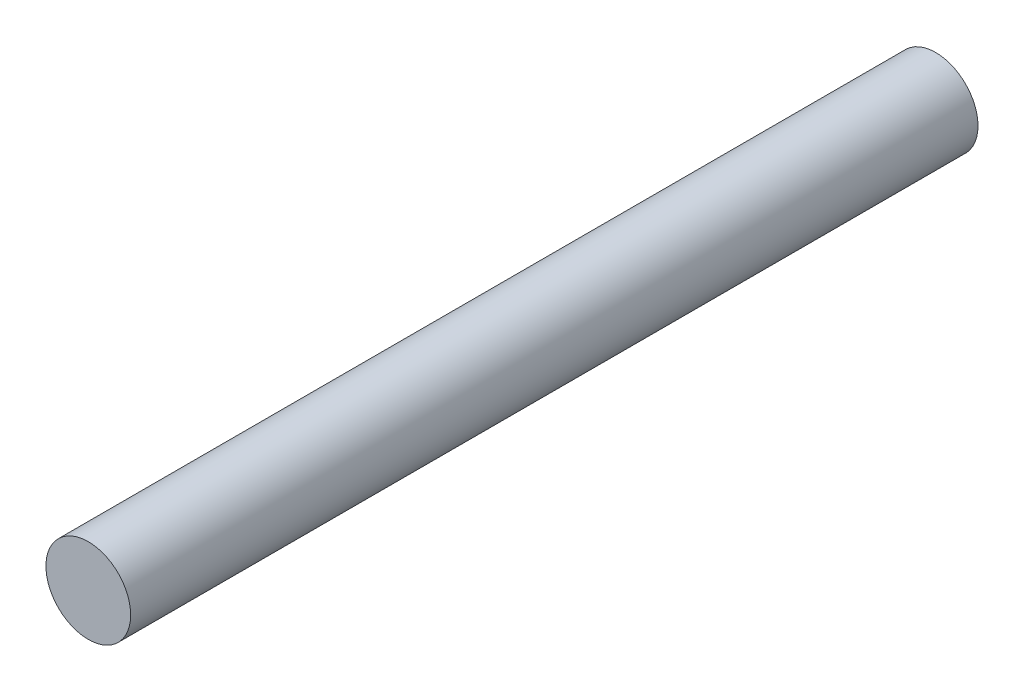
ISO-10303-21;
HEADER;
FILE_DESCRIPTION(('STEP AP214'),'2;1');
FILE_NAME('part.step','',(''),(''),'','','');
FILE_SCHEMA(('AUTOMOTIVE_DESIGN { 1 0 10303 214 1 1 1 1 }'));
ENDSEC;
DATA;
#1=APPLICATION_CONTEXT('core data for automotive mechanical design processes');
#2=APPLICATION_PROTOCOL_DEFINITION('international standard','automotive_design',2000,#1);
#3=PRODUCT_CONTEXT('',#1,'mechanical');
#4=PRODUCT('Part','Part','',(#3));
#5=PRODUCT_RELATED_PRODUCT_CATEGORY('part','',(#4));
#6=PRODUCT_DEFINITION_FORMATION('','',#4);
#7=PRODUCT_DEFINITION_CONTEXT('part definition',#1,'design');
#8=PRODUCT_DEFINITION('design','',#6,#7);
#9=PRODUCT_DEFINITION_SHAPE('','',#8);
#10=(LENGTH_UNIT() NAMED_UNIT(*) SI_UNIT(.MILLI.,.METRE.));
#11=(NAMED_UNIT(*) PLANE_ANGLE_UNIT() SI_UNIT($,.RADIAN.));
#12=(NAMED_UNIT(*) SI_UNIT($,.STERADIAN.) SOLID_ANGLE_UNIT());
#13=UNCERTAINTY_MEASURE_WITH_UNIT(LENGTH_MEASURE(1.E-05),#10,'distance_accuracy_value','');
#14=(GEOMETRIC_REPRESENTATION_CONTEXT(3) GLOBAL_UNCERTAINTY_ASSIGNED_CONTEXT((#13)) GLOBAL_UNIT_ASSIGNED_CONTEXT((#10,
#11,#12)) REPRESENTATION_CONTEXT('',''));
#15=CARTESIAN_POINT('',(0.,0.,0.));
#16=DIRECTION('',(0.,0.,1.));
#17=DIRECTION('',(1.,0.,0.));
#18=AXIS2_PLACEMENT_3D('',#15,#16,#17);
#19=CARTESIAN_POINT('',(0.,0.,200.));
#20=DIRECTION('',(0.,0.,-1.));
#21=DIRECTION('',(-1.,0.,0.));
#22=AXIS2_PLACEMENT_3D('',#19,#20,#21);
#23=CYLINDRICAL_SURFACE('',#22,10.);
#24=CARTESIAN_POINT('',(0.,0.,200.));
#25=DIRECTION('',(0.,0.,1.));
#26=DIRECTION('',(1.,0.,0.));
#27=AXIS2_PLACEMENT_3D('',#24,#25,#26);
#28=CIRCLE('',#27,10.);
#29=CARTESIAN_POINT('',(10.,0.,200.));
#30=VERTEX_POINT('',#29);
#31=EDGE_CURVE('E10',#30,#30,#28,.T.);
#32=ORIENTED_EDGE('',*,*,#31,.F.);
#33=EDGE_LOOP('',(#32));
#34=FACE_BOUND('',#33,.T.);
#35=CARTESIAN_POINT('',(0.,0.,0.));
#36=DIRECTION('',(0.,0.,1.));
#37=DIRECTION('',(1.,0.,0.));
#38=AXIS2_PLACEMENT_3D('',#35,#36,#37);
#39=CIRCLE('',#38,10.);
#40=CARTESIAN_POINT('',(10.,0.,0.));
#41=VERTEX_POINT('',#40);
#42=EDGE_CURVE('E40',#41,#41,#39,.T.);
#43=ORIENTED_EDGE('',*,*,#42,.T.);
#44=EDGE_LOOP('',(#43));
#45=FACE_BOUND('',#44,.T.);
#46=ADVANCED_FACE('F37',(#34,#45),#23,.T.);
#47=CARTESIAN_POINT('',(0.,0.,200.));
#48=DIRECTION('',(0.,0.,1.));
#49=DIRECTION('',(1.,0.,0.));
#50=AXIS2_PLACEMENT_3D('',#47,#48,#49);
#51=PLANE('',#50);
#52=ORIENTED_EDGE('',*,*,#31,.T.);
#53=EDGE_LOOP('',(#52));
#54=FACE_BOUND('',#53,.T.);
#55=ADVANCED_FACE('F54',(#54),#51,.T.);
#56=CARTESIAN_POINT('',(0.,0.,0.));
#57=DIRECTION('',(0.,0.,1.));
#58=DIRECTION('',(1.,0.,0.));
#59=AXIS2_PLACEMENT_3D('',#56,#57,#58);
#60=PLANE('',#59);
#61=ORIENTED_EDGE('',*,*,#42,.F.);
#62=EDGE_LOOP('',(#61));
#63=FACE_BOUND('',#62,.T.);
#64=ADVANCED_FACE('F52',(#63),#60,.F.);
#65=CLOSED_SHELL('',(#46,#55,#64));
#66=MANIFOLD_SOLID_BREP('B2',#65);
#67=ADVANCED_BREP_SHAPE_REPRESENTATION('',(#18,#66),#14);
#68=SHAPE_DEFINITION_REPRESENTATION(#9,#67);
ENDSEC;
END-ISO-10303-21;
